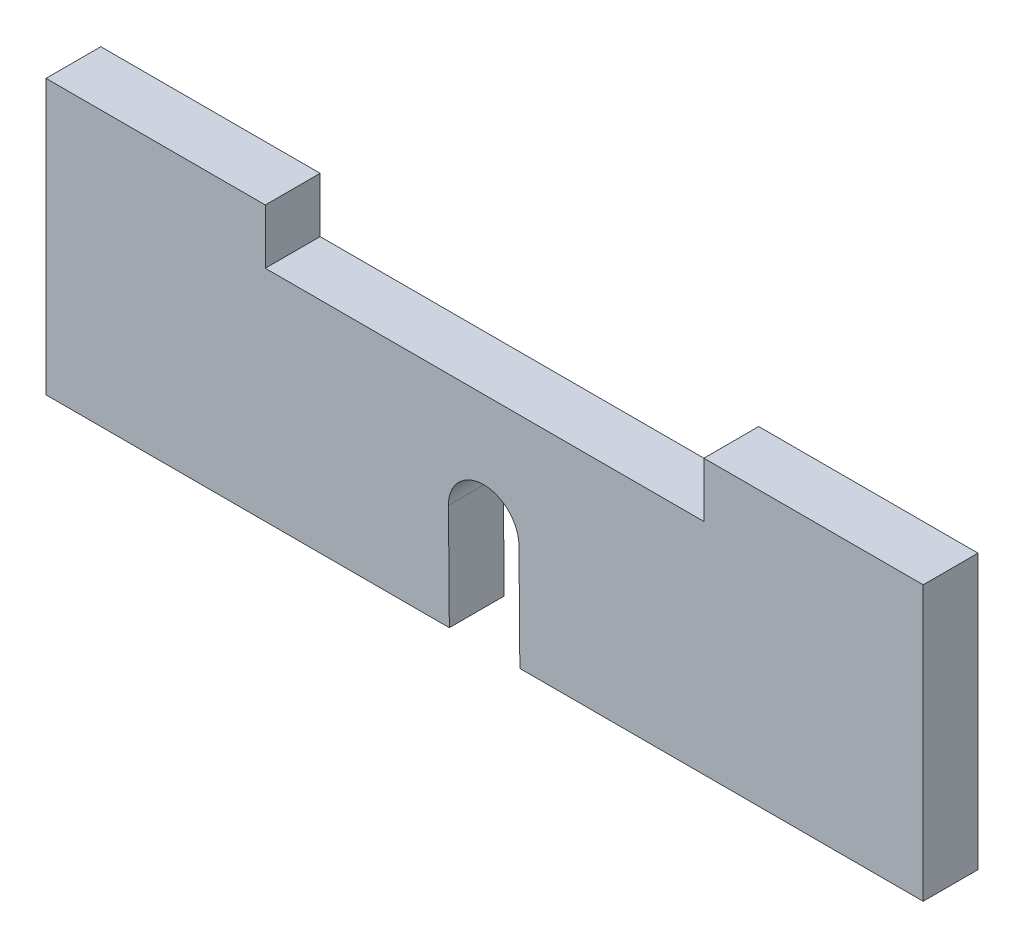
ISO-10303-21;
HEADER;
FILE_DESCRIPTION(('STEP AP214'),'2;1');
FILE_NAME('part.step','',(''),(''),'','','');
FILE_SCHEMA(('AUTOMOTIVE_DESIGN { 1 0 10303 214 1 1 1 1 }'));
ENDSEC;
DATA;
#1=APPLICATION_CONTEXT('core data for automotive mechanical design processes');
#2=APPLICATION_PROTOCOL_DEFINITION('international standard','automotive_design',2000,#1);
#3=PRODUCT_CONTEXT('',#1,'mechanical');
#4=PRODUCT('Part','Part','',(#3));
#5=PRODUCT_RELATED_PRODUCT_CATEGORY('part','',(#4));
#6=PRODUCT_DEFINITION_FORMATION('','',#4);
#7=PRODUCT_DEFINITION_CONTEXT('part definition',#1,'design');
#8=PRODUCT_DEFINITION('design','',#6,#7);
#9=PRODUCT_DEFINITION_SHAPE('','',#8);
#10=(LENGTH_UNIT() NAMED_UNIT(*) SI_UNIT(.MILLI.,.METRE.));
#11=(NAMED_UNIT(*) PLANE_ANGLE_UNIT() SI_UNIT($,.RADIAN.));
#12=(NAMED_UNIT(*) SI_UNIT($,.STERADIAN.) SOLID_ANGLE_UNIT());
#13=UNCERTAINTY_MEASURE_WITH_UNIT(LENGTH_MEASURE(1.E-05),#10,'distance_accuracy_value','');
#14=(GEOMETRIC_REPRESENTATION_CONTEXT(3) GLOBAL_UNCERTAINTY_ASSIGNED_CONTEXT((#13)) GLOBAL_UNIT_ASSIGNED_CONTEXT((#10,
#11,#12)) REPRESENTATION_CONTEXT('',''));
#15=CARTESIAN_POINT('',(0.,0.,0.));
#16=DIRECTION('',(0.,0.,1.));
#17=DIRECTION('',(1.,0.,0.));
#18=AXIS2_PLACEMENT_3D('',#15,#16,#17);
#19=CARTESIAN_POINT('',(0.,0.,3.175));
#20=DIRECTION('',(0.,1.,0.));
#21=DIRECTION('',(0.,0.,1.));
#22=AXIS2_PLACEMENT_3D('',#19,#20,#21);
#23=PLANE('',#22);
#24=DIRECTION('',(1.,0.,0.));
#25=VECTOR('',#24,1.);
#26=CARTESIAN_POINT('',(0.,0.,3.175));
#27=LINE('',#26,#25);
#28=CARTESIAN_POINT('',(27.4419803854227,0.,3.175));
#29=VERTEX_POINT('',#28);
#30=CARTESIAN_POINT('',(50.8,0.,3.175));
#31=VERTEX_POINT('',#30);
#32=EDGE_CURVE('E230',#29,#31,#27,.T.);
#33=ORIENTED_EDGE('',*,*,#32,.F.);
#34=DIRECTION('',(0.,0.,1.));
#35=VECTOR('',#34,1.);
#36=CARTESIAN_POINT('',(27.4419803854227,0.,-5.00000000001367E-05));
#37=LINE('',#36,#35);
#38=CARTESIAN_POINT('',(27.4419803854227,0.,0.));
#39=VERTEX_POINT('',#38);
#40=EDGE_CURVE('E157',#29,#39,#37,.F.);
#41=ORIENTED_EDGE('',*,*,#40,.T.);
#42=DIRECTION('',(1.,0.,0.));
#43=VECTOR('',#42,1.);
#44=CARTESIAN_POINT('',(0.,0.,0.));
#45=LINE('',#44,#43);
#46=CARTESIAN_POINT('',(50.8,0.,0.));
#47=VERTEX_POINT('',#46);
#48=EDGE_CURVE('E234',#39,#47,#45,.T.);
#49=ORIENTED_EDGE('',*,*,#48,.T.);
#50=DIRECTION('',(0.,0.,-1.));
#51=VECTOR('',#50,1.);
#52=CARTESIAN_POINT('',(50.8,0.,3.175));
#53=LINE('',#52,#51);
#54=EDGE_CURVE('E220',#31,#47,#53,.T.);
#55=ORIENTED_EDGE('',*,*,#54,.F.);
#56=EDGE_LOOP('',(#33,#41,#49,#55));
#57=FACE_BOUND('',#56,.T.);
#58=ADVANCED_FACE('F31',(#57),#23,.F.);
#59=CARTESIAN_POINT('',(0.,12.7,3.175));
#60=DIRECTION('',(0.,-1.,0.));
#61=DIRECTION('',(0.,0.,-1.));
#62=AXIS2_PLACEMENT_3D('',#59,#60,#61);
#63=PLANE('',#62);
#64=DIRECTION('',(0.,0.,1.));
#65=VECTOR('',#64,1.);
#66=CARTESIAN_POINT('',(38.1,12.7,0.));
#67=LINE('',#66,#65);
#68=CARTESIAN_POINT('',(38.1,12.7,0.));
#69=VERTEX_POINT('',#68);
#70=CARTESIAN_POINT('',(38.1,12.7,3.175));
#71=VERTEX_POINT('',#70);
#72=EDGE_CURVE('E160',#69,#71,#67,.T.);
#73=ORIENTED_EDGE('',*,*,#72,.F.);
#74=DIRECTION('',(-1.,0.,0.));
#75=VECTOR('',#74,1.);
#76=CARTESIAN_POINT('',(0.,12.7,0.));
#77=LINE('',#76,#75);
#78=CARTESIAN_POINT('',(12.7,12.7,0.));
#79=VERTEX_POINT('',#78);
#80=EDGE_CURVE('E211',#69,#79,#77,.T.);
#81=ORIENTED_EDGE('',*,*,#80,.T.);
#82=DIRECTION('',(0.,0.,-1.));
#83=VECTOR('',#82,1.);
#84=CARTESIAN_POINT('',(12.7,12.7,0.));
#85=LINE('',#84,#83);
#86=CARTESIAN_POINT('',(12.7,12.7,3.175));
#87=VERTEX_POINT('',#86);
#88=EDGE_CURVE('E179',#87,#79,#85,.T.);
#89=ORIENTED_EDGE('',*,*,#88,.F.);
#90=DIRECTION('',(-1.,0.,0.));
#91=VECTOR('',#90,1.);
#92=CARTESIAN_POINT('',(0.,12.7,3.175));
#93=LINE('',#92,#91);
#94=EDGE_CURVE('E54',#71,#87,#93,.T.);
#95=ORIENTED_EDGE('',*,*,#94,.F.);
#96=EDGE_LOOP('',(#73,#81,#89,#95));
#97=FACE_BOUND('',#96,.T.);
#98=ADVANCED_FACE('F255',(#97),#63,.F.);
#99=CARTESIAN_POINT('',(0.,0.,3.175));
#100=DIRECTION('',(1.,0.,0.));
#101=DIRECTION('',(0.,0.,-1.));
#102=AXIS2_PLACEMENT_3D('',#99,#100,#101);
#103=PLANE('',#102);
#104=DIRECTION('',(0.,-1.,0.));
#105=VECTOR('',#104,1.);
#106=CARTESIAN_POINT('',(0.,0.,0.));
#107=LINE('',#106,#105);
#108=CARTESIAN_POINT('',(0.,15.875,0.));
#109=VERTEX_POINT('',#108);
#110=CARTESIAN_POINT('',(0.,0.,0.));
#111=VERTEX_POINT('',#110);
#112=EDGE_CURVE('E208',#109,#111,#107,.T.);
#113=ORIENTED_EDGE('',*,*,#112,.T.);
#114=DIRECTION('',(0.,0.,-1.));
#115=VECTOR('',#114,1.);
#116=CARTESIAN_POINT('',(0.,0.,3.175));
#117=LINE('',#116,#115);
#118=CARTESIAN_POINT('',(0.,0.,3.175));
#119=VERTEX_POINT('',#118);
#120=EDGE_CURVE('E199',#119,#111,#117,.T.);
#121=ORIENTED_EDGE('',*,*,#120,.F.);
#122=DIRECTION('',(0.,-1.,0.));
#123=VECTOR('',#122,1.);
#124=CARTESIAN_POINT('',(0.,0.,3.175));
#125=LINE('',#124,#123);
#126=CARTESIAN_POINT('',(0.,15.875,3.175));
#127=VERTEX_POINT('',#126);
#128=EDGE_CURVE('E193',#127,#119,#125,.T.);
#129=ORIENTED_EDGE('',*,*,#128,.F.);
#130=DIRECTION('',(0.,0.,1.));
#131=VECTOR('',#130,1.);
#132=CARTESIAN_POINT('',(0.,15.875,0.));
#133=LINE('',#132,#131);
#134=EDGE_CURVE('E180',#109,#127,#133,.T.);
#135=ORIENTED_EDGE('',*,*,#134,.F.);
#136=EDGE_LOOP('',(#113,#121,#129,#135));
#137=FACE_BOUND('',#136,.T.);
#138=ADVANCED_FACE('F33',(#137),#103,.F.);
#139=CARTESIAN_POINT('',(23.3579509422981,0.,0.));
#140=VERTEX_POINT('',#139);
#141=EDGE_CURVE('E235',#111,#140,#45,.T.);
#142=ORIENTED_EDGE('',*,*,#141,.T.);
#143=DIRECTION('',(0.,0.,1.));
#144=VECTOR('',#143,1.);
#145=CARTESIAN_POINT('',(23.3579509422981,0.,3.175));
#146=LINE('',#145,#144);
#147=CARTESIAN_POINT('',(23.3579509422981,0.,3.175));
#148=VERTEX_POINT('',#147);
#149=EDGE_CURVE('E46',#140,#148,#146,.T.);
#150=ORIENTED_EDGE('',*,*,#149,.T.);
#151=EDGE_CURVE('E147',#119,#148,#27,.T.);
#152=ORIENTED_EDGE('',*,*,#151,.F.);
#153=ORIENTED_EDGE('',*,*,#120,.T.);
#154=EDGE_LOOP('',(#142,#150,#152,#153));
#155=FACE_BOUND('',#154,.T.);
#156=ADVANCED_FACE('F275',(#155),#23,.F.);
#157=CARTESIAN_POINT('',(50.8,0.,3.175));
#158=DIRECTION('',(-1.,0.,0.));
#159=DIRECTION('',(0.,0.,1.));
#160=AXIS2_PLACEMENT_3D('',#157,#158,#159);
#161=PLANE('',#160);
#162=DIRECTION('',(0.,1.,0.));
#163=VECTOR('',#162,1.);
#164=CARTESIAN_POINT('',(50.8,0.,0.));
#165=LINE('',#164,#163);
#166=CARTESIAN_POINT('',(50.8,15.875,0.));
#167=VERTEX_POINT('',#166);
#168=EDGE_CURVE('E214',#47,#167,#165,.T.);
#169=ORIENTED_EDGE('',*,*,#168,.T.);
#170=DIRECTION('',(0.,0.,-1.));
#171=VECTOR('',#170,1.);
#172=CARTESIAN_POINT('',(50.8,15.875,0.));
#173=LINE('',#172,#171);
#174=CARTESIAN_POINT('',(50.8,15.875,3.175));
#175=VERTEX_POINT('',#174);
#176=EDGE_CURVE('E167',#175,#167,#173,.T.);
#177=ORIENTED_EDGE('',*,*,#176,.F.);
#178=DIRECTION('',(0.,1.,0.));
#179=VECTOR('',#178,1.);
#180=CARTESIAN_POINT('',(50.8,0.,3.175));
#181=LINE('',#180,#179);
#182=EDGE_CURVE('E227',#31,#175,#181,.T.);
#183=ORIENTED_EDGE('',*,*,#182,.F.);
#184=ORIENTED_EDGE('',*,*,#54,.T.);
#185=EDGE_LOOP('',(#169,#177,#183,#184));
#186=FACE_BOUND('',#185,.T.);
#187=ADVANCED_FACE('F248',(#186),#161,.F.);
#188=CARTESIAN_POINT('',(0.,12.7,3.175));
#189=DIRECTION('',(0.,0.,-1.));
#190=DIRECTION('',(-1.,0.,0.));
#191=AXIS2_PLACEMENT_3D('',#188,#189,#190);
#192=PLANE('',#191);
#193=DIRECTION('',(-0.00820104116500102,0.999966370896447,0.));
#194=VECTOR('',#193,1.);
#195=CARTESIAN_POINT('',(27.3916525484363,6.14492885260219,3.175));
#196=LINE('',#195,#194);
#197=CARTESIAN_POINT('',(27.4419117154529,0.0167463651989762,3.175));
#198=VERTEX_POINT('',#197);
#199=CARTESIAN_POINT('',(27.3916525484363,6.14492885260219,3.175));
#200=VERTEX_POINT('',#199);
#201=EDGE_CURVE('E133',#198,#200,#196,.T.);
#202=ORIENTED_EDGE('',*,*,#201,.F.);
#203=CARTESIAN_POINT('',(25.4,0.,3.175));
#204=DIRECTION('',(0.,0.,1.));
#205=DIRECTION('',(1.,0.,0.));
#206=AXIS2_PLACEMENT_3D('',#203,#204,#205);
#207=CIRCLE('',#206,2.0419803854227);
#208=EDGE_CURVE('E148',#29,#198,#207,.T.);
#209=ORIENTED_EDGE('',*,*,#208,.F.);
#210=ORIENTED_EDGE('',*,*,#32,.T.);
#211=ORIENTED_EDGE('',*,*,#182,.T.);
#212=DIRECTION('',(1.,0.,0.));
#213=VECTOR('',#212,1.);
#214=CARTESIAN_POINT('',(38.1,15.875,3.175));
#215=LINE('',#214,#213);
#216=CARTESIAN_POINT('',(38.1,15.875,3.175));
#217=VERTEX_POINT('',#216);
#218=EDGE_CURVE('E164',#217,#175,#215,.T.);
#219=ORIENTED_EDGE('',*,*,#218,.F.);
#220=DIRECTION('',(0.,-1.,0.));
#221=VECTOR('',#220,1.);
#222=CARTESIAN_POINT('',(38.1,15.875,3.175));
#223=LINE('',#222,#221);
#224=EDGE_CURVE('E177',#217,#71,#223,.T.);
#225=ORIENTED_EDGE('',*,*,#224,.T.);
#226=ORIENTED_EDGE('',*,*,#94,.T.);
#227=DIRECTION('',(0.,-1.,0.));
#228=VECTOR('',#227,1.);
#229=CARTESIAN_POINT('',(12.7,15.875,3.175));
#230=LINE('',#229,#228);
#231=CARTESIAN_POINT('',(12.7,15.875,3.175));
#232=VERTEX_POINT('',#231);
#233=EDGE_CURVE('E203',#232,#87,#230,.T.);
#234=ORIENTED_EDGE('',*,*,#233,.F.);
#235=DIRECTION('',(1.,0.,0.));
#236=VECTOR('',#235,1.);
#237=CARTESIAN_POINT('',(0.,15.875,3.175));
#238=LINE('',#237,#236);
#239=EDGE_CURVE('E183',#127,#232,#238,.T.);
#240=ORIENTED_EDGE('',*,*,#239,.F.);
#241=ORIENTED_EDGE('',*,*,#128,.T.);
#242=ORIENTED_EDGE('',*,*,#151,.T.);
#243=DIRECTION('',(0.00820104116500102,-0.999966370896447,0.));
#244=VECTOR('',#243,1.);
#245=CARTESIAN_POINT('',(23.3078291175306,6.11143612220424,3.175));
#246=LINE('',#245,#244);
#247=CARTESIAN_POINT('',(23.3078291175306,6.11143612220424,3.175));
#248=VERTEX_POINT('',#247);
#249=EDGE_CURVE('E128',#248,#148,#246,.T.);
#250=ORIENTED_EDGE('',*,*,#249,.F.);
#251=CARTESIAN_POINT('',(25.3497408329834,6.12818248740321,3.175));
#252=DIRECTION('',(0.,0.,1.));
#253=DIRECTION('',(1.,0.,0.));
#254=AXIS2_PLACEMENT_3D('',#251,#252,#253);
#255=CIRCLE('',#254,2.0419803854227);
#256=EDGE_CURVE('E136',#200,#248,#255,.T.);
#257=ORIENTED_EDGE('',*,*,#256,.F.);
#258=EDGE_LOOP('',(#202,#209,#210,#211,#219,#225,#226,#234,#240,#241,#242,#250,#257));
#259=FACE_BOUND('',#258,.T.);
#260=ADVANCED_FACE('F145',(#259),#192,.F.);
#261=CARTESIAN_POINT('',(0.,12.7,0.));
#262=DIRECTION('',(0.,0.,-1.));
#263=DIRECTION('',(-1.,0.,0.));
#264=AXIS2_PLACEMENT_3D('',#261,#262,#263);
#265=PLANE('',#264);
#266=CARTESIAN_POINT('',(25.4,0.,0.));
#267=DIRECTION('',(0.,0.,-1.));
#268=DIRECTION('',(-1.,0.,0.));
#269=AXIS2_PLACEMENT_3D('',#266,#267,#268);
#270=CIRCLE('',#269,2.0419803854227);
#271=CARTESIAN_POINT('',(27.4419117154529,0.0167463651989762,0.));
#272=VERTEX_POINT('',#271);
#273=EDGE_CURVE('E11',#272,#39,#270,.T.);
#274=ORIENTED_EDGE('',*,*,#273,.F.);
#275=DIRECTION('',(0.00820104116500102,-0.999966370896447,0.));
#276=VECTOR('',#275,1.);
#277=CARTESIAN_POINT('',(27.3360536655016,12.9241916407634,0.));
#278=LINE('',#277,#276);
#279=CARTESIAN_POINT('',(27.3916525484363,6.14492885260219,0.));
#280=VERTEX_POINT('',#279);
#281=EDGE_CURVE('E39',#280,#272,#278,.T.);
#282=ORIENTED_EDGE('',*,*,#281,.F.);
#283=CARTESIAN_POINT('',(25.3497408329834,6.12818248740321,0.));
#284=DIRECTION('',(0.,0.,-1.));
#285=DIRECTION('',(-1.,0.,0.));
#286=AXIS2_PLACEMENT_3D('',#283,#284,#285);
#287=CIRCLE('',#286,2.0419803854227);
#288=CARTESIAN_POINT('',(23.3078291175306,6.11143612220424,0.));
#289=VERTEX_POINT('',#288);
#290=EDGE_CURVE('E273',#289,#280,#287,.T.);
#291=ORIENTED_EDGE('',*,*,#290,.F.);
#292=DIRECTION('',(-0.00820104116500102,0.999966370896447,0.));
#293=VECTOR('',#292,1.);
#294=CARTESIAN_POINT('',(23.2522302345959,12.8906989103654,0.));
#295=LINE('',#294,#293);
#296=EDGE_CURVE('E129',#140,#289,#295,.T.);
#297=ORIENTED_EDGE('',*,*,#296,.F.);
#298=ORIENTED_EDGE('',*,*,#141,.F.);
#299=ORIENTED_EDGE('',*,*,#112,.F.);
#300=DIRECTION('',(-1.,0.,0.));
#301=VECTOR('',#300,1.);
#302=CARTESIAN_POINT('',(0.,15.875,0.));
#303=LINE('',#302,#301);
#304=CARTESIAN_POINT('',(12.7,15.875,0.));
#305=VERTEX_POINT('',#304);
#306=EDGE_CURVE('E187',#305,#109,#303,.T.);
#307=ORIENTED_EDGE('',*,*,#306,.F.);
#308=DIRECTION('',(0.,-1.,0.));
#309=VECTOR('',#308,1.);
#310=CARTESIAN_POINT('',(12.7,15.875,0.));
#311=LINE('',#310,#309);
#312=EDGE_CURVE('E190',#305,#79,#311,.T.);
#313=ORIENTED_EDGE('',*,*,#312,.T.);
#314=ORIENTED_EDGE('',*,*,#80,.F.);
#315=DIRECTION('',(0.,-1.,0.));
#316=VECTOR('',#315,1.);
#317=CARTESIAN_POINT('',(38.1,15.875,0.));
#318=LINE('',#317,#316);
#319=CARTESIAN_POINT('',(38.1,15.875,0.));
#320=VERTEX_POINT('',#319);
#321=EDGE_CURVE('E172',#320,#69,#318,.T.);
#322=ORIENTED_EDGE('',*,*,#321,.F.);
#323=DIRECTION('',(-1.,0.,0.));
#324=VECTOR('',#323,1.);
#325=CARTESIAN_POINT('',(38.1,15.875,0.));
#326=LINE('',#325,#324);
#327=EDGE_CURVE('E170',#167,#320,#326,.T.);
#328=ORIENTED_EDGE('',*,*,#327,.F.);
#329=ORIENTED_EDGE('',*,*,#168,.F.);
#330=ORIENTED_EDGE('',*,*,#48,.F.);
#331=EDGE_LOOP('',(#274,#282,#291,#297,#298,#299,#307,#313,#314,#322,#328,#329,#330));
#332=FACE_BOUND('',#331,.T.);
#333=ADVANCED_FACE('F243',(#332),#265,.T.);
#334=CARTESIAN_POINT('',(12.7,15.875,0.));
#335=DIRECTION('',(-1.,0.,0.));
#336=DIRECTION('',(0.,0.,1.));
#337=AXIS2_PLACEMENT_3D('',#334,#335,#336);
#338=PLANE('',#337);
#339=ORIENTED_EDGE('',*,*,#88,.T.);
#340=ORIENTED_EDGE('',*,*,#312,.F.);
#341=DIRECTION('',(0.,0.,-1.));
#342=VECTOR('',#341,1.);
#343=CARTESIAN_POINT('',(12.7,15.875,0.));
#344=LINE('',#343,#342);
#345=EDGE_CURVE('E185',#232,#305,#344,.T.);
#346=ORIENTED_EDGE('',*,*,#345,.F.);
#347=ORIENTED_EDGE('',*,*,#233,.T.);
#348=EDGE_LOOP('',(#339,#340,#346,#347));
#349=FACE_BOUND('',#348,.T.);
#350=ADVANCED_FACE('F258',(#349),#338,.F.);
#351=CARTESIAN_POINT('',(0.,15.875,3.175));
#352=DIRECTION('',(0.,1.,0.));
#353=DIRECTION('',(0.,0.,1.));
#354=AXIS2_PLACEMENT_3D('',#351,#352,#353);
#355=PLANE('',#354);
#356=ORIENTED_EDGE('',*,*,#134,.T.);
#357=ORIENTED_EDGE('',*,*,#239,.T.);
#358=ORIENTED_EDGE('',*,*,#345,.T.);
#359=ORIENTED_EDGE('',*,*,#306,.T.);
#360=EDGE_LOOP('',(#356,#357,#358,#359));
#361=FACE_BOUND('',#360,.T.);
#362=ADVANCED_FACE('F263',(#361),#355,.T.);
#363=CARTESIAN_POINT('',(38.1,15.875,0.));
#364=DIRECTION('',(1.,0.,0.));
#365=DIRECTION('',(0.,0.,-1.));
#366=AXIS2_PLACEMENT_3D('',#363,#364,#365);
#367=PLANE('',#366);
#368=ORIENTED_EDGE('',*,*,#72,.T.);
#369=ORIENTED_EDGE('',*,*,#224,.F.);
#370=DIRECTION('',(0.,0.,1.));
#371=VECTOR('',#370,1.);
#372=CARTESIAN_POINT('',(38.1,15.875,0.));
#373=LINE('',#372,#371);
#374=EDGE_CURVE('E161',#320,#217,#373,.T.);
#375=ORIENTED_EDGE('',*,*,#374,.F.);
#376=ORIENTED_EDGE('',*,*,#321,.T.);
#377=EDGE_LOOP('',(#368,#369,#375,#376));
#378=FACE_BOUND('',#377,.T.);
#379=ADVANCED_FACE('F254',(#378),#367,.F.);
#380=CARTESIAN_POINT('',(38.1,15.875,3.175));
#381=DIRECTION('',(0.,1.,0.));
#382=DIRECTION('',(0.,0.,1.));
#383=AXIS2_PLACEMENT_3D('',#380,#381,#382);
#384=PLANE('',#383);
#385=ORIENTED_EDGE('',*,*,#374,.T.);
#386=ORIENTED_EDGE('',*,*,#218,.T.);
#387=ORIENTED_EDGE('',*,*,#176,.T.);
#388=ORIENTED_EDGE('',*,*,#327,.T.);
#389=EDGE_LOOP('',(#385,#386,#387,#388));
#390=FACE_BOUND('',#389,.T.);
#391=ADVANCED_FACE('F250',(#390),#384,.T.);
#392=CARTESIAN_POINT('',(25.4,0.,-5.00000000001367E-05));
#393=DIRECTION('',(0.,0.,1.));
#394=DIRECTION('',(1.,0.,0.));
#395=AXIS2_PLACEMENT_3D('',#392,#393,#394);
#396=CYLINDRICAL_SURFACE('',#395,2.0419803854227);
#397=ORIENTED_EDGE('',*,*,#208,.T.);
#398=DIRECTION('',(0.,0.,1.));
#399=VECTOR('',#398,1.);
#400=CARTESIAN_POINT('',(27.4419117154529,0.0167463651989762,-5.00000000001367E-05));
#401=LINE('',#400,#399);
#402=EDGE_CURVE('E132',#272,#198,#401,.T.);
#403=ORIENTED_EDGE('',*,*,#402,.F.);
#404=ORIENTED_EDGE('',*,*,#273,.T.);
#405=ORIENTED_EDGE('',*,*,#40,.F.);
#406=EDGE_LOOP('',(#397,#403,#404,#405));
#407=FACE_BOUND('',#406,.T.);
#408=ADVANCED_FACE('F270',(#407),#396,.F.);
#409=CARTESIAN_POINT('',(23.3078291175306,6.11143612220424,-5.00000000001367E-05));
#410=DIRECTION('',(-0.999966370896447,-0.00820104116500102,0.));
#411=DIRECTION('',(0.00820104116500102,-0.999966370896447,0.));
#412=AXIS2_PLACEMENT_3D('',#409,#410,#411);
#413=PLANE('',#412);
#414=ORIENTED_EDGE('',*,*,#296,.T.);
#415=DIRECTION('',(0.,0.,1.));
#416=VECTOR('',#415,1.);
#417=CARTESIAN_POINT('',(23.3078291175306,6.11143612220424,-5.00000000001367E-05));
#418=LINE('',#417,#416);
#419=EDGE_CURVE('E124',#289,#248,#418,.T.);
#420=ORIENTED_EDGE('',*,*,#419,.T.);
#421=ORIENTED_EDGE('',*,*,#249,.T.);
#422=ORIENTED_EDGE('',*,*,#149,.F.);
#423=EDGE_LOOP('',(#414,#420,#421,#422));
#424=FACE_BOUND('',#423,.T.);
#425=ADVANCED_FACE('F126',(#424),#413,.F.);
#426=CARTESIAN_POINT('',(25.3497408329834,6.12818248740321,-5.00000000001367E-05));
#427=DIRECTION('',(0.,0.,1.));
#428=DIRECTION('',(1.,0.,0.));
#429=AXIS2_PLACEMENT_3D('',#426,#427,#428);
#430=CYLINDRICAL_SURFACE('',#429,2.0419803854227);
#431=ORIENTED_EDGE('',*,*,#290,.T.);
#432=DIRECTION('',(0.,0.,1.));
#433=VECTOR('',#432,1.);
#434=CARTESIAN_POINT('',(27.3916525484363,6.14492885260219,-5.00000000001367E-05));
#435=LINE('',#434,#433);
#436=EDGE_CURVE('E139',#280,#200,#435,.T.);
#437=ORIENTED_EDGE('',*,*,#436,.T.);
#438=ORIENTED_EDGE('',*,*,#256,.T.);
#439=ORIENTED_EDGE('',*,*,#419,.F.);
#440=EDGE_LOOP('',(#431,#437,#438,#439));
#441=FACE_BOUND('',#440,.T.);
#442=ADVANCED_FACE('F137',(#441),#430,.F.);
#443=CARTESIAN_POINT('',(27.3916525484363,6.14492885260219,-5.00000000001367E-05));
#444=DIRECTION('',(0.999966370896447,0.00820104116500102,0.));
#445=DIRECTION('',(-0.00820104116500102,0.999966370896447,0.));
#446=AXIS2_PLACEMENT_3D('',#443,#444,#445);
#447=PLANE('',#446);
#448=ORIENTED_EDGE('',*,*,#281,.T.);
#449=ORIENTED_EDGE('',*,*,#402,.T.);
#450=ORIENTED_EDGE('',*,*,#201,.T.);
#451=ORIENTED_EDGE('',*,*,#436,.F.);
#452=EDGE_LOOP('',(#448,#449,#450,#451));
#453=FACE_BOUND('',#452,.T.);
#454=ADVANCED_FACE('F272',(#453),#447,.F.);
#455=CLOSED_SHELL('',(#58,#98,#138,#156,#187,#260,#333,#350,#362,#379,#391,#408,#425,#442,#454));
#456=MANIFOLD_SOLID_BREP('B2',#455);
#457=ADVANCED_BREP_SHAPE_REPRESENTATION('',(#18,#456),#14);
#458=SHAPE_DEFINITION_REPRESENTATION(#9,#457);
ENDSEC;
END-ISO-10303-21;
